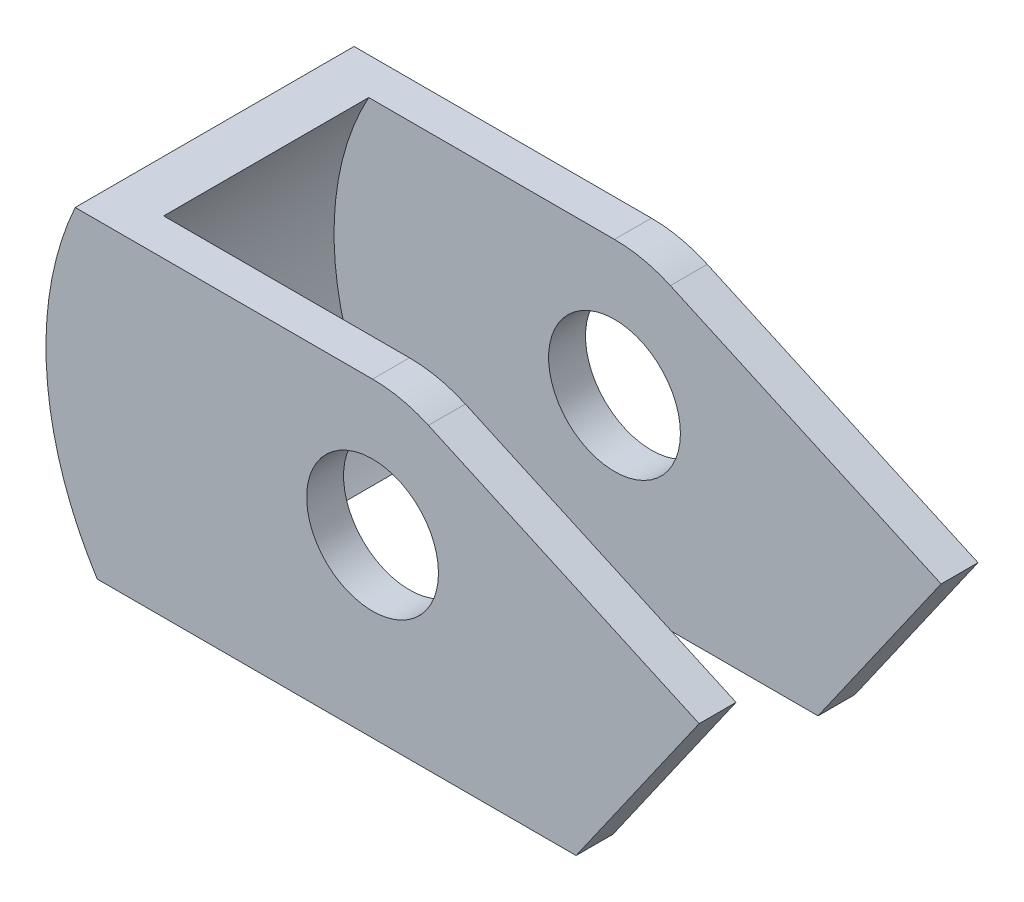
ISO-10303-21;
HEADER;
FILE_DESCRIPTION(('STEP AP214'),'2;1');
FILE_NAME('part.step','',(''),(''),'','','');
FILE_SCHEMA(('AUTOMOTIVE_DESIGN { 1 0 10303 214 1 1 1 1 }'));
ENDSEC;
DATA;
#1=APPLICATION_CONTEXT('core data for automotive mechanical design processes');
#2=APPLICATION_PROTOCOL_DEFINITION('international standard','automotive_design',2000,#1);
#3=PRODUCT_CONTEXT('',#1,'mechanical');
#4=PRODUCT('Part','Part','',(#3));
#5=PRODUCT_RELATED_PRODUCT_CATEGORY('part','',(#4));
#6=PRODUCT_DEFINITION_FORMATION('','',#4);
#7=PRODUCT_DEFINITION_CONTEXT('part definition',#1,'design');
#8=PRODUCT_DEFINITION('design','',#6,#7);
#9=PRODUCT_DEFINITION_SHAPE('','',#8);
#10=(LENGTH_UNIT() NAMED_UNIT(*) SI_UNIT(.MILLI.,.METRE.));
#11=(NAMED_UNIT(*) PLANE_ANGLE_UNIT() SI_UNIT($,.RADIAN.));
#12=(NAMED_UNIT(*) SI_UNIT($,.STERADIAN.) SOLID_ANGLE_UNIT());
#13=UNCERTAINTY_MEASURE_WITH_UNIT(LENGTH_MEASURE(1.E-05),#10,'distance_accuracy_value','');
#14=(GEOMETRIC_REPRESENTATION_CONTEXT(3) GLOBAL_UNCERTAINTY_ASSIGNED_CONTEXT((#13)) GLOBAL_UNIT_ASSIGNED_CONTEXT((#10,
#11,#12)) REPRESENTATION_CONTEXT('',''));
#15=CARTESIAN_POINT('',(0.,0.,0.));
#16=DIRECTION('',(0.,0.,1.));
#17=DIRECTION('',(1.,0.,0.));
#18=AXIS2_PLACEMENT_3D('',#15,#16,#17);
#19=CARTESIAN_POINT('',(0.,0.,0.));
#20=DIRECTION('',(0.,0.,1.));
#21=DIRECTION('',(1.,0.,0.));
#22=AXIS2_PLACEMENT_3D('',#19,#20,#21);
#23=PLANE('',#22);
#24=CARTESIAN_POINT('',(0.,0.,0.));
#25=DIRECTION('',(0.,0.,1.));
#26=DIRECTION('',(1.,0.,0.));
#27=AXIS2_PLACEMENT_3D('',#24,#25,#26);
#28=CIRCLE('',#27,14.2875);
#29=CARTESIAN_POINT('',(14.2875,0.,0.));
#30=VERTEX_POINT('',#29);
#31=EDGE_CURVE('E164',#30,#30,#28,.T.);
#32=ORIENTED_EDGE('',*,*,#31,.T.);
#33=EDGE_LOOP('',(#32));
#34=FACE_BOUND('',#33,.T.);
#35=CARTESIAN_POINT('',(0.,0.,0.));
#36=DIRECTION('',(0.,0.,1.));
#37=DIRECTION('',(1.,0.,0.));
#38=AXIS2_PLACEMENT_3D('',#35,#36,#37);
#39=CIRCLE('',#38,60.8);
#40=CARTESIAN_POINT('',(-53.2811631230963,29.2875,0.));
#41=VERTEX_POINT('',#40);
#42=CARTESIAN_POINT('',(-47.3817475405878,-38.1,0.));
#43=VERTEX_POINT('',#42);
#44=EDGE_CURVE('E57',#41,#43,#39,.T.);
#45=ORIENTED_EDGE('',*,*,#44,.F.);
#46=DIRECTION('',(-1.,0.,0.));
#47=VECTOR('',#46,1.);
#48=CARTESIAN_POINT('',(0.,29.2875,0.));
#49=LINE('',#48,#47);
#50=CARTESIAN_POINT('',(0.,29.2875,0.));
#51=VERTEX_POINT('',#50);
#52=EDGE_CURVE('E154',#51,#41,#49,.T.);
#53=ORIENTED_EDGE('',*,*,#52,.F.);
#54=CARTESIAN_POINT('',(0.,0.,0.));
#55=DIRECTION('',(0.,0.,1.));
#56=DIRECTION('',(1.,0.,0.));
#57=AXIS2_PLACEMENT_3D('',#54,#55,#56);
#58=CIRCLE('',#57,29.2875);
#59=CARTESIAN_POINT('',(12.1152211334746,26.66419083972,0.));
#60=VERTEX_POINT('',#59);
#61=EDGE_CURVE('E150',#60,#51,#58,.T.);
#62=ORIENTED_EDGE('',*,*,#61,.F.);
#63=DIRECTION('',(-0.910429051292192,0.413665254237288,0.));
#64=VECTOR('',#63,1.);
#65=CARTESIAN_POINT('',(12.1152211334746,26.66419083972,0.));
#66=LINE('',#65,#64);
#67=CARTESIAN_POINT('',(70.8,0.,0.));
#68=VERTEX_POINT('',#67);
#69=EDGE_CURVE('E147',#68,#60,#66,.T.);
#70=ORIENTED_EDGE('',*,*,#69,.F.);
#71=DIRECTION('',(-0.57357643635105,-0.819152044288989,0.));
#72=VECTOR('',#71,1.);
#73=CARTESIAN_POINT('',(47.5075130737283,-33.2651187758213,0.));
#74=LINE('',#73,#72);
#75=CARTESIAN_POINT('',(44.1220927942098,-38.1,0.));
#76=VERTEX_POINT('',#75);
#77=EDGE_CURVE('E160',#68,#76,#74,.T.);
#78=ORIENTED_EDGE('',*,*,#77,.T.);
#79=DIRECTION('',(1.,0.,0.));
#80=VECTOR('',#79,1.);
#81=CARTESIAN_POINT('',(0.,-38.1,0.));
#82=LINE('',#81,#80);
#83=EDGE_CURVE('E157',#43,#76,#82,.T.);
#84=ORIENTED_EDGE('',*,*,#83,.F.);
#85=EDGE_LOOP('',(#45,#53,#62,#70,#78,#84));
#86=FACE_BOUND('',#85,.T.);
#87=ADVANCED_FACE('F41',(#34,#86),#23,.F.);
#88=CARTESIAN_POINT('',(12.1152211334746,26.66419083972,8.));
#89=DIRECTION('',(-0.413665254237288,-0.910429051292191,0.));
#90=DIRECTION('',(0.910429051292192,-0.413665254237288,0.));
#91=AXIS2_PLACEMENT_3D('',#88,#89,#90);
#92=PLANE('',#91);
#93=ORIENTED_EDGE('',*,*,#69,.T.);
#94=DIRECTION('',(0.,0.,-1.));
#95=VECTOR('',#94,1.);
#96=CARTESIAN_POINT('',(12.1152211334746,26.66419083972,8.));
#97=LINE('',#96,#95);
#98=CARTESIAN_POINT('',(12.1152211334746,26.66419083972,8.));
#99=VERTEX_POINT('',#98);
#100=EDGE_CURVE('E11',#99,#60,#97,.T.);
#101=ORIENTED_EDGE('',*,*,#100,.F.);
#102=DIRECTION('',(-0.910429051292192,0.413665254237288,0.));
#103=VECTOR('',#102,1.);
#104=CARTESIAN_POINT('',(12.1152211334746,26.66419083972,8.));
#105=LINE('',#104,#103);
#106=CARTESIAN_POINT('',(70.8,0.,8.));
#107=VERTEX_POINT('',#106);
#108=EDGE_CURVE('E168',#107,#99,#105,.T.);
#109=ORIENTED_EDGE('',*,*,#108,.F.);
#110=DIRECTION('',(0.,0.,-1.));
#111=VECTOR('',#110,1.);
#112=CARTESIAN_POINT('',(70.8,0.,8.));
#113=LINE('',#112,#111);
#114=EDGE_CURVE('E66',#107,#68,#113,.T.);
#115=ORIENTED_EDGE('',*,*,#114,.T.);
#116=EDGE_LOOP('',(#93,#101,#109,#115));
#117=FACE_BOUND('',#116,.T.);
#118=ADVANCED_FACE('F43',(#117),#92,.F.);
#119=CARTESIAN_POINT('',(0.,0.,8.));
#120=DIRECTION('',(0.,0.,-1.));
#121=DIRECTION('',(-1.,0.,0.));
#122=AXIS2_PLACEMENT_3D('',#119,#120,#121);
#123=CYLINDRICAL_SURFACE('',#122,29.2875);
#124=ORIENTED_EDGE('',*,*,#61,.T.);
#125=DIRECTION('',(0.,0.,-1.));
#126=VECTOR('',#125,1.);
#127=CARTESIAN_POINT('',(0.,29.2875,8.));
#128=LINE('',#127,#126);
#129=CARTESIAN_POINT('',(0.,29.2875,8.));
#130=VERTEX_POINT('',#129);
#131=EDGE_CURVE('E50',#130,#51,#128,.T.);
#132=ORIENTED_EDGE('',*,*,#131,.F.);
#133=CARTESIAN_POINT('',(0.,0.,8.));
#134=DIRECTION('',(0.,0.,1.));
#135=DIRECTION('',(1.,0.,0.));
#136=AXIS2_PLACEMENT_3D('',#133,#134,#135);
#137=CIRCLE('',#136,29.2875);
#138=EDGE_CURVE('E93',#99,#130,#137,.T.);
#139=ORIENTED_EDGE('',*,*,#138,.F.);
#140=ORIENTED_EDGE('',*,*,#100,.T.);
#141=EDGE_LOOP('',(#124,#132,#139,#140));
#142=FACE_BOUND('',#141,.T.);
#143=ADVANCED_FACE('F181',(#142),#123,.T.);
#144=CARTESIAN_POINT('',(0.,29.2875,8.));
#145=DIRECTION('',(0.,-1.,0.));
#146=DIRECTION('',(0.,0.,-1.));
#147=AXIS2_PLACEMENT_3D('',#144,#145,#146);
#148=PLANE('',#147);
#149=ORIENTED_EDGE('',*,*,#52,.T.);
#150=DIRECTION('',(0.,0.,1.));
#151=VECTOR('',#150,1.);
#152=CARTESIAN_POINT('',(-53.2811631230963,29.2875,-44.45));
#153=LINE('',#152,#151);
#154=CARTESIAN_POINT('',(-53.2811631230963,29.2875,-44.45));
#155=VERTEX_POINT('',#154);
#156=EDGE_CURVE('E461',#155,#41,#153,.T.);
#157=ORIENTED_EDGE('',*,*,#156,.F.);
#158=DIRECTION('',(-1.,0.,0.));
#159=VECTOR('',#158,1.);
#160=CARTESIAN_POINT('',(0.,29.2875,-44.45));
#161=LINE('',#160,#159);
#162=CARTESIAN_POINT('',(0.,29.2875,-44.45));
#163=VERTEX_POINT('',#162);
#164=EDGE_CURVE('E434',#163,#155,#161,.T.);
#165=ORIENTED_EDGE('',*,*,#164,.F.);
#166=DIRECTION('',(0.,0.,1.));
#167=VECTOR('',#166,1.);
#168=CARTESIAN_POINT('',(0.,29.2875,-52.45));
#169=LINE('',#168,#167);
#170=CARTESIAN_POINT('',(0.,29.2875,-52.45));
#171=VERTEX_POINT('',#170);
#172=EDGE_CURVE('E415',#171,#163,#169,.T.);
#173=ORIENTED_EDGE('',*,*,#172,.F.);
#174=DIRECTION('',(-1.,0.,0.));
#175=VECTOR('',#174,1.);
#176=CARTESIAN_POINT('',(0.,29.2875,-52.45));
#177=LINE('',#176,#175);
#178=CARTESIAN_POINT('',(-64.4583768314872,29.2875,-52.45));
#179=VERTEX_POINT('',#178);
#180=EDGE_CURVE('E418',#171,#179,#177,.T.);
#181=ORIENTED_EDGE('',*,*,#180,.T.);
#182=DIRECTION('',(0.,0.,-1.));
#183=VECTOR('',#182,1.);
#184=CARTESIAN_POINT('',(-64.4583768314872,29.2875,8.));
#185=LINE('',#184,#183);
#186=CARTESIAN_POINT('',(-64.4583768314872,29.2875,8.));
#187=VERTEX_POINT('',#186);
#188=EDGE_CURVE('E131',#187,#179,#185,.T.);
#189=ORIENTED_EDGE('',*,*,#188,.F.);
#190=DIRECTION('',(-1.,0.,0.));
#191=VECTOR('',#190,1.);
#192=CARTESIAN_POINT('',(0.,29.2875,8.));
#193=LINE('',#192,#191);
#194=EDGE_CURVE('E114',#130,#187,#193,.T.);
#195=ORIENTED_EDGE('',*,*,#194,.F.);
#196=ORIENTED_EDGE('',*,*,#131,.T.);
#197=EDGE_LOOP('',(#149,#157,#165,#173,#181,#189,#195,#196));
#198=FACE_BOUND('',#197,.T.);
#199=ADVANCED_FACE('F177',(#198),#148,.F.);
#200=CARTESIAN_POINT('',(0.,0.,8.));
#201=DIRECTION('',(0.,0.,-1.));
#202=DIRECTION('',(-1.,0.,0.));
#203=AXIS2_PLACEMENT_3D('',#200,#201,#202);
#204=CYLINDRICAL_SURFACE('',#203,70.8);
#205=ORIENTED_EDGE('',*,*,#188,.T.);
#206=CARTESIAN_POINT('',(0.,0.,-52.45));
#207=DIRECTION('',(0.,0.,1.));
#208=DIRECTION('',(1.,0.,0.));
#209=AXIS2_PLACEMENT_3D('',#206,#207,#208);
#210=CIRCLE('',#209,70.8);
#211=CARTESIAN_POINT('',(-59.6743663560829,-38.1,-52.45));
#212=VERTEX_POINT('',#211);
#213=EDGE_CURVE('E126',#179,#212,#210,.T.);
#214=ORIENTED_EDGE('',*,*,#213,.T.);
#215=DIRECTION('',(0.,0.,-1.));
#216=VECTOR('',#215,1.);
#217=CARTESIAN_POINT('',(-59.6743663560829,-38.1,8.));
#218=LINE('',#217,#216);
#219=CARTESIAN_POINT('',(-59.6743663560829,-38.1,8.));
#220=VERTEX_POINT('',#219);
#221=EDGE_CURVE('E122',#220,#212,#218,.T.);
#222=ORIENTED_EDGE('',*,*,#221,.F.);
#223=CARTESIAN_POINT('',(0.,0.,8.));
#224=DIRECTION('',(0.,0.,1.));
#225=DIRECTION('',(1.,0.,0.));
#226=AXIS2_PLACEMENT_3D('',#223,#224,#225);
#227=CIRCLE('',#226,70.8);
#228=EDGE_CURVE('E105',#187,#220,#227,.T.);
#229=ORIENTED_EDGE('',*,*,#228,.F.);
#230=EDGE_LOOP('',(#205,#214,#222,#229));
#231=FACE_BOUND('',#230,.T.);
#232=ADVANCED_FACE('F123',(#231),#204,.T.);
#233=CARTESIAN_POINT('',(0.,-38.1,8.));
#234=DIRECTION('',(0.,1.,0.));
#235=DIRECTION('',(0.,0.,1.));
#236=AXIS2_PLACEMENT_3D('',#233,#234,#235);
#237=PLANE('',#236);
#238=ORIENTED_EDGE('',*,*,#221,.T.);
#239=DIRECTION('',(1.,0.,0.));
#240=VECTOR('',#239,1.);
#241=CARTESIAN_POINT('',(0.,-38.1,-52.45));
#242=LINE('',#241,#240);
#243=CARTESIAN_POINT('',(44.1220927942098,-38.1,-52.45));
#244=VERTEX_POINT('',#243);
#245=EDGE_CURVE('E506',#212,#244,#242,.T.);
#246=ORIENTED_EDGE('',*,*,#245,.T.);
#247=DIRECTION('',(0.,0.,1.));
#248=VECTOR('',#247,1.);
#249=CARTESIAN_POINT('',(44.1220927942098,-38.1,-52.45));
#250=LINE('',#249,#248);
#251=CARTESIAN_POINT('',(44.1220927942098,-38.1,-44.45));
#252=VERTEX_POINT('',#251);
#253=EDGE_CURVE('E449',#244,#252,#250,.T.);
#254=ORIENTED_EDGE('',*,*,#253,.T.);
#255=DIRECTION('',(1.,0.,0.));
#256=VECTOR('',#255,1.);
#257=CARTESIAN_POINT('',(0.,-38.1,-44.45));
#258=LINE('',#257,#256);
#259=CARTESIAN_POINT('',(-47.3817475405878,-38.1,-44.45));
#260=VERTEX_POINT('',#259);
#261=EDGE_CURVE('E430',#260,#252,#258,.T.);
#262=ORIENTED_EDGE('',*,*,#261,.F.);
#263=DIRECTION('',(0.,0.,1.));
#264=VECTOR('',#263,1.);
#265=CARTESIAN_POINT('',(-47.3817475405878,-38.1,-44.45));
#266=LINE('',#265,#264);
#267=EDGE_CURVE('E151',#260,#43,#266,.T.);
#268=ORIENTED_EDGE('',*,*,#267,.T.);
#269=ORIENTED_EDGE('',*,*,#83,.T.);
#270=DIRECTION('',(0.,0.,-1.));
#271=VECTOR('',#270,1.);
#272=CARTESIAN_POINT('',(44.1220927942098,-38.1,8.));
#273=LINE('',#272,#271);
#274=CARTESIAN_POINT('',(44.1220927942098,-38.1,8.));
#275=VERTEX_POINT('',#274);
#276=EDGE_CURVE('E132',#275,#76,#273,.T.);
#277=ORIENTED_EDGE('',*,*,#276,.F.);
#278=DIRECTION('',(1.,0.,0.));
#279=VECTOR('',#278,1.);
#280=CARTESIAN_POINT('',(0.,-38.1,8.));
#281=LINE('',#280,#279);
#282=EDGE_CURVE('E111',#220,#275,#281,.T.);
#283=ORIENTED_EDGE('',*,*,#282,.F.);
#284=EDGE_LOOP('',(#238,#246,#254,#262,#268,#269,#277,#283));
#285=FACE_BOUND('',#284,.T.);
#286=ADVANCED_FACE('F134',(#285),#237,.F.);
#287=CARTESIAN_POINT('',(47.5075130737283,-33.2651187758213,8.));
#288=DIRECTION('',(0.819152044288989,-0.57357643635105,0.));
#289=DIRECTION('',(0.57357643635105,0.819152044288989,0.));
#290=AXIS2_PLACEMENT_3D('',#287,#288,#289);
#291=PLANE('',#290);
#292=ORIENTED_EDGE('',*,*,#77,.F.);
#293=ORIENTED_EDGE('',*,*,#114,.F.);
#294=DIRECTION('',(-0.57357643635105,-0.819152044288989,0.));
#295=VECTOR('',#294,1.);
#296=CARTESIAN_POINT('',(47.5075130737283,-33.2651187758213,8.));
#297=LINE('',#296,#295);
#298=EDGE_CURVE('E137',#107,#275,#297,.T.);
#299=ORIENTED_EDGE('',*,*,#298,.T.);
#300=ORIENTED_EDGE('',*,*,#276,.T.);
#301=EDGE_LOOP('',(#292,#293,#299,#300));
#302=FACE_BOUND('',#301,.T.);
#303=ADVANCED_FACE('F197',(#302),#291,.T.);
#304=CARTESIAN_POINT('',(0.,0.,8.));
#305=DIRECTION('',(0.,0.,-1.));
#306=DIRECTION('',(-1.,0.,0.));
#307=AXIS2_PLACEMENT_3D('',#304,#305,#306);
#308=CYLINDRICAL_SURFACE('',#307,14.2875);
#309=CARTESIAN_POINT('',(0.,0.,8.));
#310=DIRECTION('',(0.,0.,1.));
#311=DIRECTION('',(1.,0.,0.));
#312=AXIS2_PLACEMENT_3D('',#309,#310,#311);
#313=CIRCLE('',#312,14.2875);
#314=CARTESIAN_POINT('',(14.2875,0.,8.));
#315=VERTEX_POINT('',#314);
#316=EDGE_CURVE('E140',#315,#315,#313,.T.);
#317=ORIENTED_EDGE('',*,*,#316,.T.);
#318=EDGE_LOOP('',(#317));
#319=FACE_BOUND('',#318,.T.);
#320=ORIENTED_EDGE('',*,*,#31,.F.);
#321=EDGE_LOOP('',(#320));
#322=FACE_BOUND('',#321,.T.);
#323=ADVANCED_FACE('F194',(#319,#322),#308,.F.);
#324=CARTESIAN_POINT('',(0.,0.,8.));
#325=DIRECTION('',(0.,0.,1.));
#326=DIRECTION('',(1.,0.,0.));
#327=AXIS2_PLACEMENT_3D('',#324,#325,#326);
#328=PLANE('',#327);
#329=ORIENTED_EDGE('',*,*,#108,.T.);
#330=ORIENTED_EDGE('',*,*,#138,.T.);
#331=ORIENTED_EDGE('',*,*,#194,.T.);
#332=ORIENTED_EDGE('',*,*,#228,.T.);
#333=ORIENTED_EDGE('',*,*,#282,.T.);
#334=ORIENTED_EDGE('',*,*,#298,.F.);
#335=EDGE_LOOP('',(#329,#330,#331,#332,#333,#334));
#336=FACE_BOUND('',#335,.T.);
#337=ORIENTED_EDGE('',*,*,#316,.F.);
#338=EDGE_LOOP('',(#337));
#339=FACE_BOUND('',#338,.T.);
#340=ADVANCED_FACE('F107',(#336,#339),#328,.T.);
#341=CARTESIAN_POINT('',(0.,0.,-44.45));
#342=DIRECTION('',(0.,0.,1.));
#343=DIRECTION('',(1.,0.,0.));
#344=AXIS2_PLACEMENT_3D('',#341,#342,#343);
#345=CYLINDRICAL_SURFACE('',#344,60.8);
#346=ORIENTED_EDGE('',*,*,#44,.T.);
#347=ORIENTED_EDGE('',*,*,#267,.F.);
#348=CARTESIAN_POINT('',(0.,0.,-44.45));
#349=DIRECTION('',(0.,0.,1.));
#350=DIRECTION('',(1.,0.,0.));
#351=AXIS2_PLACEMENT_3D('',#348,#349,#350);
#352=CIRCLE('',#351,60.8);
#353=EDGE_CURVE('E457',#155,#260,#352,.T.);
#354=ORIENTED_EDGE('',*,*,#353,.F.);
#355=ORIENTED_EDGE('',*,*,#156,.T.);
#356=EDGE_LOOP('',(#346,#347,#354,#355));
#357=FACE_BOUND('',#356,.T.);
#358=ADVANCED_FACE('F233',(#357),#345,.F.);
#359=CARTESIAN_POINT('',(0.,0.,-44.45));
#360=DIRECTION('',(0.,0.,-1.));
#361=DIRECTION('',(1.,0.,0.));
#362=AXIS2_PLACEMENT_3D('',#359,#360,#361);
#363=PLANE('',#362);
#364=CARTESIAN_POINT('',(0.,0.,-44.45));
#365=DIRECTION('',(0.,0.,1.));
#366=DIRECTION('',(1.,0.,0.));
#367=AXIS2_PLACEMENT_3D('',#364,#365,#366);
#368=CIRCLE('',#367,14.2875);
#369=CARTESIAN_POINT('',(14.2875,0.,-44.45));
#370=VERTEX_POINT('',#369);
#371=EDGE_CURVE('E442',#370,#370,#368,.T.);
#372=ORIENTED_EDGE('',*,*,#371,.F.);
#373=EDGE_LOOP('',(#372));
#374=FACE_BOUND('',#373,.T.);
#375=ORIENTED_EDGE('',*,*,#164,.T.);
#376=ORIENTED_EDGE('',*,*,#353,.T.);
#377=ORIENTED_EDGE('',*,*,#261,.T.);
#378=DIRECTION('',(-0.57357643635105,-0.819152044288989,0.));
#379=VECTOR('',#378,1.);
#380=CARTESIAN_POINT('',(47.5075130737283,-33.2651187758213,-44.45));
#381=LINE('',#380,#379);
#382=CARTESIAN_POINT('',(70.8,0.,-44.45));
#383=VERTEX_POINT('',#382);
#384=EDGE_CURVE('E426',#383,#252,#381,.T.);
#385=ORIENTED_EDGE('',*,*,#384,.F.);
#386=DIRECTION('',(-0.910429051292192,0.413665254237288,0.));
#387=VECTOR('',#386,1.);
#388=CARTESIAN_POINT('',(12.1152211334746,26.66419083972,-44.45));
#389=LINE('',#388,#387);
#390=CARTESIAN_POINT('',(12.1152211334746,26.66419083972,-44.45));
#391=VERTEX_POINT('',#390);
#392=EDGE_CURVE('E422',#383,#391,#389,.T.);
#393=ORIENTED_EDGE('',*,*,#392,.T.);
#394=CARTESIAN_POINT('',(0.,0.,-44.45));
#395=DIRECTION('',(0.,0.,1.));
#396=DIRECTION('',(1.,0.,0.));
#397=AXIS2_PLACEMENT_3D('',#394,#395,#396);
#398=CIRCLE('',#397,29.2875);
#399=EDGE_CURVE('E438',#391,#163,#398,.T.);
#400=ORIENTED_EDGE('',*,*,#399,.T.);
#401=EDGE_LOOP('',(#375,#376,#377,#385,#393,#400));
#402=FACE_BOUND('',#401,.T.);
#403=ADVANCED_FACE('F238',(#374,#402),#363,.F.);
#404=CARTESIAN_POINT('',(12.1152211334746,26.66419083972,-52.45));
#405=DIRECTION('',(0.413665254237288,0.910429051292191,0.));
#406=DIRECTION('',(-0.910429051292192,0.413665254237288,0.));
#407=AXIS2_PLACEMENT_3D('',#404,#405,#406);
#408=PLANE('',#407);
#409=ORIENTED_EDGE('',*,*,#392,.F.);
#410=DIRECTION('',(0.,0.,1.));
#411=VECTOR('',#410,1.);
#412=CARTESIAN_POINT('',(70.8,0.,-52.45));
#413=LINE('',#412,#411);
#414=CARTESIAN_POINT('',(70.8,0.,-52.45));
#415=VERTEX_POINT('',#414);
#416=EDGE_CURVE('E453',#415,#383,#413,.T.);
#417=ORIENTED_EDGE('',*,*,#416,.F.);
#418=DIRECTION('',(-0.910429051292192,0.413665254237288,0.));
#419=VECTOR('',#418,1.);
#420=CARTESIAN_POINT('',(12.1152211334746,26.66419083972,-52.45));
#421=LINE('',#420,#419);
#422=CARTESIAN_POINT('',(12.1152211334746,26.66419083972,-52.45));
#423=VERTEX_POINT('',#422);
#424=EDGE_CURVE('E404',#415,#423,#421,.T.);
#425=ORIENTED_EDGE('',*,*,#424,.T.);
#426=DIRECTION('',(0.,0.,1.));
#427=VECTOR('',#426,1.);
#428=CARTESIAN_POINT('',(12.1152211334746,26.66419083972,-52.45));
#429=LINE('',#428,#427);
#430=EDGE_CURVE('E409',#423,#391,#429,.T.);
#431=ORIENTED_EDGE('',*,*,#430,.T.);
#432=EDGE_LOOP('',(#409,#417,#425,#431));
#433=FACE_BOUND('',#432,.T.);
#434=ADVANCED_FACE('F245',(#433),#408,.T.);
#435=CARTESIAN_POINT('',(47.5075130737283,-33.2651187758213,-52.45));
#436=DIRECTION('',(-0.819152044288989,0.57357643635105,0.));
#437=DIRECTION('',(-0.57357643635105,-0.819152044288989,0.));
#438=AXIS2_PLACEMENT_3D('',#435,#436,#437);
#439=PLANE('',#438);
#440=ORIENTED_EDGE('',*,*,#384,.T.);
#441=ORIENTED_EDGE('',*,*,#253,.F.);
#442=DIRECTION('',(-0.57357643635105,-0.819152044288989,0.));
#443=VECTOR('',#442,1.);
#444=CARTESIAN_POINT('',(47.5075130737283,-33.2651187758213,-52.45));
#445=LINE('',#444,#443);
#446=EDGE_CURVE('E504',#415,#244,#445,.T.);
#447=ORIENTED_EDGE('',*,*,#446,.F.);
#448=ORIENTED_EDGE('',*,*,#416,.T.);
#449=EDGE_LOOP('',(#440,#441,#447,#448));
#450=FACE_BOUND('',#449,.T.);
#451=ADVANCED_FACE('F253',(#450),#439,.F.);
#452=CARTESIAN_POINT('',(0.,0.,-52.45));
#453=DIRECTION('',(0.,0.,1.));
#454=DIRECTION('',(1.,0.,0.));
#455=AXIS2_PLACEMENT_3D('',#452,#453,#454);
#456=CYLINDRICAL_SURFACE('',#455,29.2875);
#457=ORIENTED_EDGE('',*,*,#399,.F.);
#458=ORIENTED_EDGE('',*,*,#430,.F.);
#459=CARTESIAN_POINT('',(0.,0.,-52.45));
#460=DIRECTION('',(0.,0.,1.));
#461=DIRECTION('',(1.,0.,0.));
#462=AXIS2_PLACEMENT_3D('',#459,#460,#461);
#463=CIRCLE('',#462,29.2875);
#464=EDGE_CURVE('E410',#423,#171,#463,.T.);
#465=ORIENTED_EDGE('',*,*,#464,.T.);
#466=ORIENTED_EDGE('',*,*,#172,.T.);
#467=EDGE_LOOP('',(#457,#458,#465,#466));
#468=FACE_BOUND('',#467,.T.);
#469=ADVANCED_FACE('F261',(#468),#456,.T.);
#470=CARTESIAN_POINT('',(0.,0.,-52.45));
#471=DIRECTION('',(0.,0.,1.));
#472=DIRECTION('',(1.,0.,0.));
#473=AXIS2_PLACEMENT_3D('',#470,#471,#472);
#474=CYLINDRICAL_SURFACE('',#473,14.2875);
#475=CARTESIAN_POINT('',(0.,0.,-52.45));
#476=DIRECTION('',(0.,0.,1.));
#477=DIRECTION('',(1.,0.,0.));
#478=AXIS2_PLACEMENT_3D('',#475,#476,#477);
#479=CIRCLE('',#478,14.2875);
#480=CARTESIAN_POINT('',(14.2875,0.,-52.45));
#481=VERTEX_POINT('',#480);
#482=EDGE_CURVE('E407',#481,#481,#479,.T.);
#483=ORIENTED_EDGE('',*,*,#482,.F.);
#484=EDGE_LOOP('',(#483));
#485=FACE_BOUND('',#484,.T.);
#486=ORIENTED_EDGE('',*,*,#371,.T.);
#487=EDGE_LOOP('',(#486));
#488=FACE_BOUND('',#487,.T.);
#489=ADVANCED_FACE('F269',(#485,#488),#474,.F.);
#490=CARTESIAN_POINT('',(0.,0.,-52.45));
#491=DIRECTION('',(0.,0.,-1.));
#492=DIRECTION('',(1.,0.,0.));
#493=AXIS2_PLACEMENT_3D('',#490,#491,#492);
#494=PLANE('',#493);
#495=ORIENTED_EDGE('',*,*,#424,.F.);
#496=ORIENTED_EDGE('',*,*,#446,.T.);
#497=ORIENTED_EDGE('',*,*,#245,.F.);
#498=ORIENTED_EDGE('',*,*,#213,.F.);
#499=ORIENTED_EDGE('',*,*,#180,.F.);
#500=ORIENTED_EDGE('',*,*,#464,.F.);
#501=EDGE_LOOP('',(#495,#496,#497,#498,#499,#500));
#502=FACE_BOUND('',#501,.T.);
#503=ORIENTED_EDGE('',*,*,#482,.T.);
#504=EDGE_LOOP('',(#503));
#505=FACE_BOUND('',#504,.T.);
#506=ADVANCED_FACE('F277',(#502,#505),#494,.T.);
#507=CLOSED_SHELL('',(#87,#118,#143,#199,#232,#286,#303,#323,#340,#358,#403,#434,#451,#469,#489,#506));
#508=MANIFOLD_SOLID_BREP('B2',#507);
#509=ADVANCED_BREP_SHAPE_REPRESENTATION('',(#18,#508),#14);
#510=SHAPE_DEFINITION_REPRESENTATION(#9,#509);
ENDSEC;
END-ISO-10303-21;
